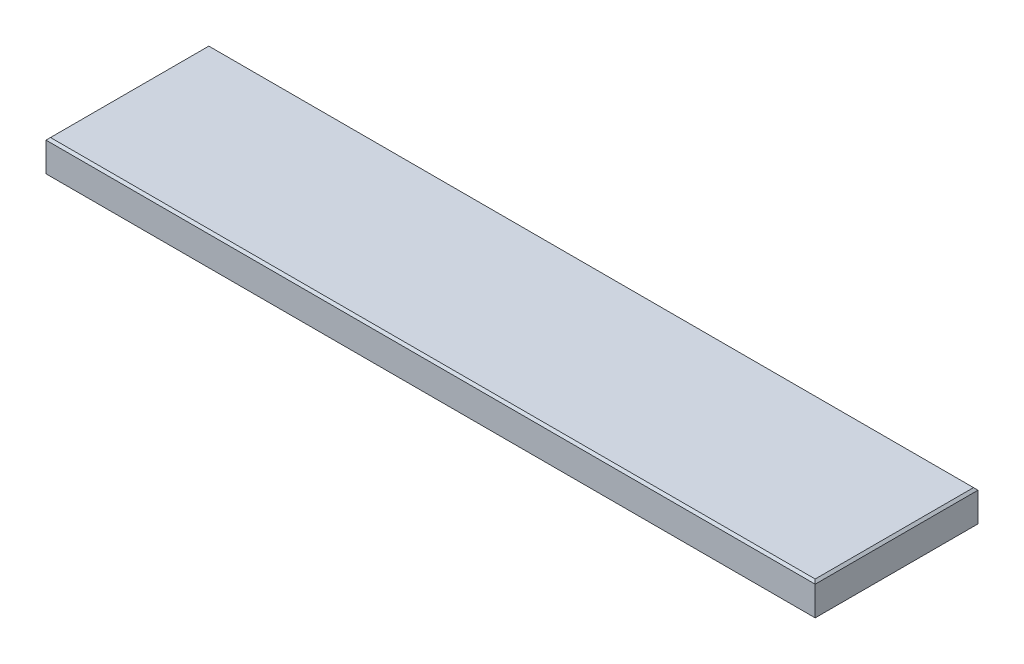
ISO-10303-21;
HEADER;
FILE_DESCRIPTION(('STEP AP214'),'2;1');
FILE_NAME('part.step','',(''),(''),'','','');
FILE_SCHEMA(('AUTOMOTIVE_DESIGN { 1 0 10303 214 1 1 1 1 }'));
ENDSEC;
DATA;
#1=APPLICATION_CONTEXT('core data for automotive mechanical design processes');
#2=APPLICATION_PROTOCOL_DEFINITION('international standard','automotive_design',2000,#1);
#3=PRODUCT_CONTEXT('',#1,'mechanical');
#4=PRODUCT('Part','Part','',(#3));
#5=PRODUCT_RELATED_PRODUCT_CATEGORY('part','',(#4));
#6=PRODUCT_DEFINITION_FORMATION('','',#4);
#7=PRODUCT_DEFINITION_CONTEXT('part definition',#1,'design');
#8=PRODUCT_DEFINITION('design','',#6,#7);
#9=PRODUCT_DEFINITION_SHAPE('','',#8);
#10=(LENGTH_UNIT() NAMED_UNIT(*) SI_UNIT(.MILLI.,.METRE.));
#11=(NAMED_UNIT(*) PLANE_ANGLE_UNIT() SI_UNIT($,.RADIAN.));
#12=(NAMED_UNIT(*) SI_UNIT($,.STERADIAN.) SOLID_ANGLE_UNIT());
#13=UNCERTAINTY_MEASURE_WITH_UNIT(LENGTH_MEASURE(1.E-05),#10,'distance_accuracy_value','');
#14=(GEOMETRIC_REPRESENTATION_CONTEXT(3) GLOBAL_UNCERTAINTY_ASSIGNED_CONTEXT((#13)) GLOBAL_UNIT_ASSIGNED_CONTEXT((#10,
#11,#12)) REPRESENTATION_CONTEXT('',''));
#15=CARTESIAN_POINT('',(0.,0.,0.));
#16=DIRECTION('',(0.,0.,1.));
#17=DIRECTION('',(1.,0.,0.));
#18=AXIS2_PLACEMENT_3D('',#15,#16,#17);
#19=CARTESIAN_POINT('',(0.,38.1,0.));
#20=DIRECTION('',(1.,0.,0.));
#21=DIRECTION('',(0.,0.,-1.));
#22=AXIS2_PLACEMENT_3D('',#19,#20,#21);
#23=PLANE('',#22);
#24=DIRECTION('',(0.,-1.,0.));
#25=VECTOR('',#24,1.);
#26=CARTESIAN_POINT('',(0.,38.1,-184.15));
#27=LINE('',#26,#25);
#28=CARTESIAN_POINT('',(0.,35.5599999999999,-184.15));
#29=VERTEX_POINT('',#28);
#30=CARTESIAN_POINT('',(0.,2.54,-184.15));
#31=VERTEX_POINT('',#30);
#32=EDGE_CURVE('E150',#29,#31,#27,.T.);
#33=ORIENTED_EDGE('',*,*,#32,.T.);
#34=DIRECTION('',(0.,0.,1.));
#35=VECTOR('',#34,1.);
#36=CARTESIAN_POINT('',(0.,2.53999999999999,0.));
#37=LINE('',#36,#35);
#38=CARTESIAN_POINT('',(0.,2.54,0.));
#39=VERTEX_POINT('',#38);
#40=EDGE_CURVE('E159',#31,#39,#37,.T.);
#41=ORIENTED_EDGE('',*,*,#40,.T.);
#42=DIRECTION('',(0.,-1.,0.));
#43=VECTOR('',#42,1.);
#44=CARTESIAN_POINT('',(0.,38.1,0.));
#45=LINE('',#44,#43);
#46=CARTESIAN_POINT('',(0.,35.5599999999999,0.));
#47=VERTEX_POINT('',#46);
#48=EDGE_CURVE('E128',#47,#39,#45,.T.);
#49=ORIENTED_EDGE('',*,*,#48,.F.);
#50=DIRECTION('',(0.,0.,-1.));
#51=VECTOR('',#50,1.);
#52=CARTESIAN_POINT('',(0.,35.5599999999999,0.));
#53=LINE('',#52,#51);
#54=EDGE_CURVE('E161',#47,#29,#53,.T.);
#55=ORIENTED_EDGE('',*,*,#54,.T.);
#56=EDGE_LOOP('',(#33,#41,#49,#55));
#57=FACE_BOUND('',#56,.T.);
#58=ADVANCED_FACE('F40',(#57),#23,.F.);
#59=CARTESIAN_POINT('',(0.,38.1,0.));
#60=DIRECTION('',(0.,0.,-1.));
#61=DIRECTION('',(-1.,0.,0.));
#62=AXIS2_PLACEMENT_3D('',#59,#60,#61);
#63=PLANE('',#62);
#64=ORIENTED_EDGE('',*,*,#48,.T.);
#65=DIRECTION('',(1.,0.,0.));
#66=VECTOR('',#65,1.);
#67=CARTESIAN_POINT('',(869.95,2.53999999999999,0.));
#68=LINE('',#67,#66);
#69=CARTESIAN_POINT('',(869.95,2.54,0.));
#70=VERTEX_POINT('',#69);
#71=EDGE_CURVE('E127',#39,#70,#68,.T.);
#72=ORIENTED_EDGE('',*,*,#71,.T.);
#73=DIRECTION('',(0.,-1.,0.));
#74=VECTOR('',#73,1.);
#75=CARTESIAN_POINT('',(869.95,38.1,0.));
#76=LINE('',#75,#74);
#77=CARTESIAN_POINT('',(869.95,35.5599999999999,0.));
#78=VERTEX_POINT('',#77);
#79=EDGE_CURVE('E110',#78,#70,#76,.T.);
#80=ORIENTED_EDGE('',*,*,#79,.F.);
#81=DIRECTION('',(-1.,0.,0.));
#82=VECTOR('',#81,1.);
#83=CARTESIAN_POINT('',(0.,35.5599999999999,0.));
#84=LINE('',#83,#82);
#85=EDGE_CURVE('E124',#78,#47,#84,.T.);
#86=ORIENTED_EDGE('',*,*,#85,.T.);
#87=EDGE_LOOP('',(#64,#72,#80,#86));
#88=FACE_BOUND('',#87,.T.);
#89=ADVANCED_FACE('F123',(#88),#63,.F.);
#90=CARTESIAN_POINT('',(869.95,38.1,0.));
#91=DIRECTION('',(-1.,0.,0.));
#92=DIRECTION('',(0.,0.,1.));
#93=AXIS2_PLACEMENT_3D('',#90,#91,#92);
#94=PLANE('',#93);
#95=ORIENTED_EDGE('',*,*,#79,.T.);
#96=DIRECTION('',(0.,0.,-1.));
#97=VECTOR('',#96,1.);
#98=CARTESIAN_POINT('',(869.95,2.53999999999999,-184.15));
#99=LINE('',#98,#97);
#100=CARTESIAN_POINT('',(869.95,2.54,-184.15));
#101=VERTEX_POINT('',#100);
#102=EDGE_CURVE('E116',#70,#101,#99,.T.);
#103=ORIENTED_EDGE('',*,*,#102,.T.);
#104=DIRECTION('',(0.,-1.,0.));
#105=VECTOR('',#104,1.);
#106=CARTESIAN_POINT('',(869.95,38.1,-184.15));
#107=LINE('',#106,#105);
#108=CARTESIAN_POINT('',(869.95,35.5599999999999,-184.15));
#109=VERTEX_POINT('',#108);
#110=EDGE_CURVE('E112',#109,#101,#107,.T.);
#111=ORIENTED_EDGE('',*,*,#110,.F.);
#112=DIRECTION('',(0.,0.,1.));
#113=VECTOR('',#112,1.);
#114=CARTESIAN_POINT('',(869.95,35.5599999999999,0.));
#115=LINE('',#114,#113);
#116=EDGE_CURVE('E107',#109,#78,#115,.T.);
#117=ORIENTED_EDGE('',*,*,#116,.T.);
#118=EDGE_LOOP('',(#95,#103,#111,#117));
#119=FACE_BOUND('',#118,.T.);
#120=ADVANCED_FACE('F109',(#119),#94,.F.);
#121=CARTESIAN_POINT('',(0.,38.1,-184.15));
#122=DIRECTION('',(0.,0.,1.));
#123=DIRECTION('',(1.,0.,0.));
#124=AXIS2_PLACEMENT_3D('',#121,#122,#123);
#125=PLANE('',#124);
#126=ORIENTED_EDGE('',*,*,#110,.T.);
#127=DIRECTION('',(-1.,0.,0.));
#128=VECTOR('',#127,1.);
#129=CARTESIAN_POINT('',(0.,2.53999999999999,-184.15));
#130=LINE('',#129,#128);
#131=EDGE_CURVE('E163',#101,#31,#130,.T.);
#132=ORIENTED_EDGE('',*,*,#131,.T.);
#133=ORIENTED_EDGE('',*,*,#32,.F.);
#134=DIRECTION('',(1.,0.,0.));
#135=VECTOR('',#134,1.);
#136=CARTESIAN_POINT('',(0.,35.5599999999999,-184.15));
#137=LINE('',#136,#135);
#138=EDGE_CURVE('E165',#29,#109,#137,.T.);
#139=ORIENTED_EDGE('',*,*,#138,.T.);
#140=EDGE_LOOP('',(#126,#132,#133,#139));
#141=FACE_BOUND('',#140,.T.);
#142=ADVANCED_FACE('F203',(#141),#125,.F.);
#143=CARTESIAN_POINT('',(0.,38.1,0.));
#144=DIRECTION('',(0.,-1.,0.));
#145=DIRECTION('',(0.,0.,-1.));
#146=AXIS2_PLACEMENT_3D('',#143,#144,#145);
#147=PLANE('',#146);
#148=DIRECTION('',(0.,0.,-1.));
#149=VECTOR('',#148,1.);
#150=CARTESIAN_POINT('',(867.41,38.1,0.));
#151=LINE('',#150,#149);
#152=CARTESIAN_POINT('',(867.41,38.1,-2.5400000000001));
#153=VERTEX_POINT('',#152);
#154=CARTESIAN_POINT('',(867.41,38.1,-181.61));
#155=VERTEX_POINT('',#154);
#156=EDGE_CURVE('E50',#153,#155,#151,.T.);
#157=ORIENTED_EDGE('',*,*,#156,.T.);
#158=DIRECTION('',(-1.,0.,0.));
#159=VECTOR('',#158,1.);
#160=CARTESIAN_POINT('',(0.,38.1,-181.61));
#161=LINE('',#160,#159);
#162=CARTESIAN_POINT('',(2.5400000000001,38.1,-181.61));
#163=VERTEX_POINT('',#162);
#164=EDGE_CURVE('E11',#155,#163,#161,.T.);
#165=ORIENTED_EDGE('',*,*,#164,.T.);
#166=DIRECTION('',(0.,0.,1.));
#167=VECTOR('',#166,1.);
#168=CARTESIAN_POINT('',(2.54000000000009,38.1,0.));
#169=LINE('',#168,#167);
#170=CARTESIAN_POINT('',(2.54000000000009,38.1,-2.5400000000001));
#171=VERTEX_POINT('',#170);
#172=EDGE_CURVE('E157',#163,#171,#169,.T.);
#173=ORIENTED_EDGE('',*,*,#172,.T.);
#174=DIRECTION('',(1.,0.,0.));
#175=VECTOR('',#174,1.);
#176=CARTESIAN_POINT('',(0.,38.1,-2.5400000000001));
#177=LINE('',#176,#175);
#178=EDGE_CURVE('E61',#171,#153,#177,.T.);
#179=ORIENTED_EDGE('',*,*,#178,.T.);
#180=EDGE_LOOP('',(#157,#165,#173,#179));
#181=FACE_BOUND('',#180,.T.);
#182=ADVANCED_FACE('F209',(#181),#147,.F.);
#183=CARTESIAN_POINT('',(0.,0.,0.));
#184=DIRECTION('',(0.,-1.,0.));
#185=DIRECTION('',(0.,0.,-1.));
#186=AXIS2_PLACEMENT_3D('',#183,#184,#185);
#187=PLANE('',#186);
#188=DIRECTION('',(0.,0.,1.));
#189=VECTOR('',#188,1.);
#190=CARTESIAN_POINT('',(867.41,0.,0.));
#191=LINE('',#190,#189);
#192=CARTESIAN_POINT('',(867.41,0.,-181.61));
#193=VERTEX_POINT('',#192);
#194=CARTESIAN_POINT('',(867.41,0.,-2.5400000000001));
#195=VERTEX_POINT('',#194);
#196=EDGE_CURVE('E170',#193,#195,#191,.T.);
#197=ORIENTED_EDGE('',*,*,#196,.T.);
#198=DIRECTION('',(-1.,0.,0.));
#199=VECTOR('',#198,1.);
#200=CARTESIAN_POINT('',(0.,0.,-2.5400000000001));
#201=LINE('',#200,#199);
#202=CARTESIAN_POINT('',(2.54000000000009,0.,-2.5400000000001));
#203=VERTEX_POINT('',#202);
#204=EDGE_CURVE('E117',#195,#203,#201,.T.);
#205=ORIENTED_EDGE('',*,*,#204,.T.);
#206=DIRECTION('',(0.,0.,-1.));
#207=VECTOR('',#206,1.);
#208=CARTESIAN_POINT('',(2.5400000000001,0.,-184.15));
#209=LINE('',#208,#207);
#210=CARTESIAN_POINT('',(2.5400000000001,0.,-181.61));
#211=VERTEX_POINT('',#210);
#212=EDGE_CURVE('E174',#203,#211,#209,.T.);
#213=ORIENTED_EDGE('',*,*,#212,.T.);
#214=DIRECTION('',(1.,0.,0.));
#215=VECTOR('',#214,1.);
#216=CARTESIAN_POINT('',(869.95,0.,-181.61));
#217=LINE('',#216,#215);
#218=EDGE_CURVE('E172',#211,#193,#217,.T.);
#219=ORIENTED_EDGE('',*,*,#218,.T.);
#220=EDGE_LOOP('',(#197,#205,#213,#219));
#221=FACE_BOUND('',#220,.T.);
#222=ADVANCED_FACE('F211',(#221),#187,.T.);
#223=CARTESIAN_POINT('',(0.,2.53999999999999,-184.15));
#224=DIRECTION('',(0.,-0.707106781186563,-0.707106781186532));
#225=DIRECTION('',(1.,0.,0.));
#226=AXIS2_PLACEMENT_3D('',#223,#224,#225);
#227=PLANE('',#226);
#228=DIRECTION('',(-0.577350269189634,-0.577350269189609,0.577350269189634));
#229=VECTOR('',#228,1.);
#230=CARTESIAN_POINT('',(579.966666666658,-287.443333333329,105.833333333342));
#231=LINE('',#230,#229);
#232=EDGE_CURVE('E151',#193,#101,#231,.F.);
#233=ORIENTED_EDGE('',*,*,#232,.F.);
#234=ORIENTED_EDGE('',*,*,#218,.F.);
#235=DIRECTION('',(0.577350269189634,-0.577350269189609,0.577350269189634));
#236=VECTOR('',#235,1.);
#237=CARTESIAN_POINT('',(61.3833333333351,-58.8433333333325,-122.766666666665));
#238=LINE('',#237,#236);
#239=EDGE_CURVE('E147',#31,#211,#238,.T.);
#240=ORIENTED_EDGE('',*,*,#239,.F.);
#241=ORIENTED_EDGE('',*,*,#131,.F.);
#242=EDGE_LOOP('',(#233,#234,#240,#241));
#243=FACE_BOUND('',#242,.T.);
#244=ADVANCED_FACE('F190',(#243),#227,.T.);
#245=CARTESIAN_POINT('',(0.,2.53999999999999,0.));
#246=DIRECTION('',(-0.707106781186532,-0.707106781186563,0.));
#247=DIRECTION('',(0.,0.,-1.));
#248=AXIS2_PLACEMENT_3D('',#245,#246,#247);
#249=PLANE('',#248);
#250=ORIENTED_EDGE('',*,*,#239,.T.);
#251=ORIENTED_EDGE('',*,*,#212,.F.);
#252=DIRECTION('',(-0.577350269189634,0.577350269189609,0.577350269189634));
#253=VECTOR('',#252,1.);
#254=CARTESIAN_POINT('',(0.,2.53999999999999,0.));
#255=LINE('',#254,#253);
#256=EDGE_CURVE('E138',#39,#203,#255,.F.);
#257=ORIENTED_EDGE('',*,*,#256,.F.);
#258=ORIENTED_EDGE('',*,*,#40,.F.);
#259=EDGE_LOOP('',(#250,#251,#257,#258));
#260=FACE_BOUND('',#259,.T.);
#261=ADVANCED_FACE('F194',(#260),#249,.T.);
#262=CARTESIAN_POINT('',(869.95,2.53999999999999,0.));
#263=DIRECTION('',(0.707106781186532,-0.707106781186563,0.));
#264=DIRECTION('',(0.,0.,1.));
#265=AXIS2_PLACEMENT_3D('',#262,#263,#264);
#266=PLANE('',#265);
#267=ORIENTED_EDGE('',*,*,#232,.T.);
#268=ORIENTED_EDGE('',*,*,#102,.F.);
#269=DIRECTION('',(-0.577350269189634,-0.577350269189609,-0.577350269189634));
#270=VECTOR('',#269,1.);
#271=CARTESIAN_POINT('',(869.95,2.53999999999999,0.));
#272=LINE('',#271,#270);
#273=EDGE_CURVE('E137',#195,#70,#272,.F.);
#274=ORIENTED_EDGE('',*,*,#273,.F.);
#275=ORIENTED_EDGE('',*,*,#196,.F.);
#276=EDGE_LOOP('',(#267,#268,#274,#275));
#277=FACE_BOUND('',#276,.T.);
#278=ADVANCED_FACE('F202',(#277),#266,.T.);
#279=CARTESIAN_POINT('',(0.,2.53999999999999,0.));
#280=DIRECTION('',(0.,-0.707106781186563,0.707106781186532));
#281=DIRECTION('',(-1.,0.,0.));
#282=AXIS2_PLACEMENT_3D('',#279,#280,#281);
#283=PLANE('',#282);
#284=ORIENTED_EDGE('',*,*,#256,.T.);
#285=ORIENTED_EDGE('',*,*,#204,.F.);
#286=ORIENTED_EDGE('',*,*,#273,.T.);
#287=ORIENTED_EDGE('',*,*,#71,.F.);
#288=EDGE_LOOP('',(#284,#285,#286,#287));
#289=FACE_BOUND('',#288,.T.);
#290=ADVANCED_FACE('F197',(#289),#283,.T.);
#291=CARTESIAN_POINT('',(0.,38.1,-2.5400000000001));
#292=DIRECTION('',(0.,-0.707106781186547,-0.707106781186548));
#293=DIRECTION('',(1.,0.,0.));
#294=AXIS2_PLACEMENT_3D('',#291,#292,#293);
#295=PLANE('',#294);
#296=DIRECTION('',(0.577350269189626,0.577350269189626,-0.577350269189626));
#297=VECTOR('',#296,1.);
#298=CARTESIAN_POINT('',(1.69333333333339,37.2533333333333,-1.6933333333334));
#299=LINE('',#298,#297);
#300=EDGE_CURVE('E133',#47,#171,#299,.T.);
#301=ORIENTED_EDGE('',*,*,#300,.F.);
#302=ORIENTED_EDGE('',*,*,#85,.F.);
#303=DIRECTION('',(-0.577350269189626,0.577350269189626,-0.577350269189626));
#304=VECTOR('',#303,1.);
#305=CARTESIAN_POINT('',(578.273333333333,327.236666666667,-291.676666666667));
#306=LINE('',#305,#304);
#307=EDGE_CURVE('E45',#153,#78,#306,.F.);
#308=ORIENTED_EDGE('',*,*,#307,.F.);
#309=ORIENTED_EDGE('',*,*,#178,.F.);
#310=EDGE_LOOP('',(#301,#302,#308,#309));
#311=FACE_BOUND('',#310,.T.);
#312=ADVANCED_FACE('F43',(#311),#295,.F.);
#313=CARTESIAN_POINT('',(867.41,38.1,0.));
#314=DIRECTION('',(-0.707106781186548,-0.707106781186548,0.));
#315=DIRECTION('',(0.,0.,-1.));
#316=AXIS2_PLACEMENT_3D('',#313,#314,#315);
#317=PLANE('',#316);
#318=ORIENTED_EDGE('',*,*,#307,.T.);
#319=ORIENTED_EDGE('',*,*,#116,.F.);
#320=DIRECTION('',(-0.577350269189626,0.577350269189626,0.577350269189626));
#321=VECTOR('',#320,1.);
#322=CARTESIAN_POINT('',(806.873333333333,98.6366666666666,-121.073333333333));
#323=LINE('',#322,#321);
#324=EDGE_CURVE('E140',#155,#109,#323,.F.);
#325=ORIENTED_EDGE('',*,*,#324,.F.);
#326=ORIENTED_EDGE('',*,*,#156,.F.);
#327=EDGE_LOOP('',(#318,#319,#325,#326));
#328=FACE_BOUND('',#327,.T.);
#329=ADVANCED_FACE('F136',(#328),#317,.F.);
#330=CARTESIAN_POINT('',(2.54000000000009,38.1,0.));
#331=DIRECTION('',(0.707106781186548,-0.707106781186547,0.));
#332=DIRECTION('',(0.,0.,1.));
#333=AXIS2_PLACEMENT_3D('',#330,#331,#332);
#334=PLANE('',#333);
#335=ORIENTED_EDGE('',*,*,#300,.T.);
#336=ORIENTED_EDGE('',*,*,#172,.F.);
#337=DIRECTION('',(-0.577350269189626,-0.577350269189626,-0.577350269189626));
#338=VECTOR('',#337,1.);
#339=CARTESIAN_POINT('',(63.0766666666667,98.6366666666667,-121.073333333333));
#340=LINE('',#339,#338);
#341=EDGE_CURVE('E143',#29,#163,#340,.F.);
#342=ORIENTED_EDGE('',*,*,#341,.F.);
#343=ORIENTED_EDGE('',*,*,#54,.F.);
#344=EDGE_LOOP('',(#335,#336,#342,#343));
#345=FACE_BOUND('',#344,.T.);
#346=ADVANCED_FACE('F208',(#345),#334,.F.);
#347=CARTESIAN_POINT('',(0.,38.1,-181.61));
#348=DIRECTION('',(0.,-0.707106781186548,0.707106781186548));
#349=DIRECTION('',(-1.,0.,0.));
#350=AXIS2_PLACEMENT_3D('',#347,#348,#349);
#351=PLANE('',#350);
#352=ORIENTED_EDGE('',*,*,#324,.T.);
#353=ORIENTED_EDGE('',*,*,#138,.F.);
#354=ORIENTED_EDGE('',*,*,#341,.T.);
#355=ORIENTED_EDGE('',*,*,#164,.F.);
#356=EDGE_LOOP('',(#352,#353,#354,#355));
#357=FACE_BOUND('',#356,.T.);
#358=ADVANCED_FACE('F206',(#357),#351,.F.);
#359=CLOSED_SHELL('',(#58,#89,#120,#142,#182,#222,#244,#261,#278,#290,#312,#329,#346,#358));
#360=MANIFOLD_SOLID_BREP('B2',#359);
#361=ADVANCED_BREP_SHAPE_REPRESENTATION('',(#18,#360),#14);
#362=SHAPE_DEFINITION_REPRESENTATION(#9,#361);
ENDSEC;
END-ISO-10303-21;
